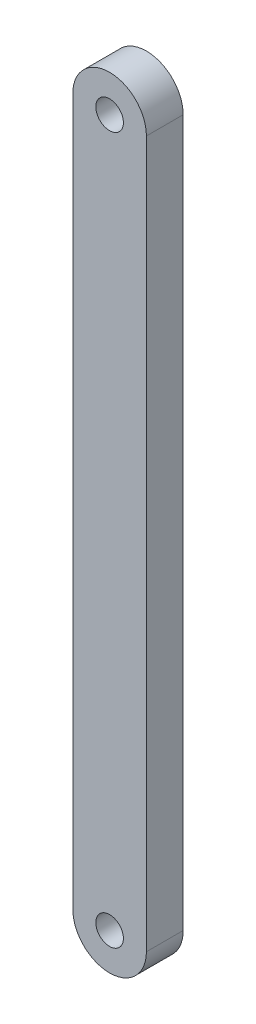
ISO-10303-21;
HEADER;
FILE_DESCRIPTION(('STEP AP214'),'2;1');
FILE_NAME('part.step','',(''),(''),'','','');
FILE_SCHEMA(('AUTOMOTIVE_DESIGN { 1 0 10303 214 1 1 1 1 }'));
ENDSEC;
DATA;
#1=APPLICATION_CONTEXT('core data for automotive mechanical design processes');
#2=APPLICATION_PROTOCOL_DEFINITION('international standard','automotive_design',2000,#1);
#3=PRODUCT_CONTEXT('',#1,'mechanical');
#4=PRODUCT('Part','Part','',(#3));
#5=PRODUCT_RELATED_PRODUCT_CATEGORY('part','',(#4));
#6=PRODUCT_DEFINITION_FORMATION('','',#4);
#7=PRODUCT_DEFINITION_CONTEXT('part definition',#1,'design');
#8=PRODUCT_DEFINITION('design','',#6,#7);
#9=PRODUCT_DEFINITION_SHAPE('','',#8);
#10=(LENGTH_UNIT() NAMED_UNIT(*) SI_UNIT(.MILLI.,.METRE.));
#11=(NAMED_UNIT(*) PLANE_ANGLE_UNIT() SI_UNIT($,.RADIAN.));
#12=(NAMED_UNIT(*) SI_UNIT($,.STERADIAN.) SOLID_ANGLE_UNIT());
#13=UNCERTAINTY_MEASURE_WITH_UNIT(LENGTH_MEASURE(1.E-05),#10,'distance_accuracy_value','');
#14=(GEOMETRIC_REPRESENTATION_CONTEXT(3) GLOBAL_UNCERTAINTY_ASSIGNED_CONTEXT((#13)) GLOBAL_UNIT_ASSIGNED_CONTEXT((#10,
#11,#12)) REPRESENTATION_CONTEXT('',''));
#15=CARTESIAN_POINT('',(0.,0.,0.));
#16=DIRECTION('',(0.,0.,1.));
#17=DIRECTION('',(1.,0.,0.));
#18=AXIS2_PLACEMENT_3D('',#15,#16,#17);
#19=CARTESIAN_POINT('',(0.,121.92,12.7));
#20=DIRECTION('',(0.,0.,1.));
#21=DIRECTION('',(1.,0.,0.));
#22=AXIS2_PLACEMENT_3D('',#19,#20,#21);
#23=PLANE('',#22);
#24=CARTESIAN_POINT('',(0.,121.92,12.7));
#25=DIRECTION('',(0.,0.,1.));
#26=DIRECTION('',(1.,0.,0.));
#27=AXIS2_PLACEMENT_3D('',#24,#25,#26);
#28=CIRCLE('',#27,4.7625);
#29=CARTESIAN_POINT('',(4.76249999999997,121.92,12.7));
#30=VERTEX_POINT('',#29);
#31=EDGE_CURVE('E100',#30,#30,#28,.T.);
#32=ORIENTED_EDGE('',*,*,#31,.F.);
#33=EDGE_LOOP('',(#32));
#34=FACE_BOUND('',#33,.T.);
#35=CARTESIAN_POINT('',(0.,121.92,12.7));
#36=DIRECTION('',(0.,0.,1.));
#37=DIRECTION('',(1.,0.,0.));
#38=AXIS2_PLACEMENT_3D('',#35,#36,#37);
#39=CIRCLE('',#38,12.7);
#40=CARTESIAN_POINT('',(12.7,121.92,12.7));
#41=VERTEX_POINT('',#40);
#42=CARTESIAN_POINT('',(-12.7,121.92,12.7));
#43=VERTEX_POINT('',#42);
#44=EDGE_CURVE('E85',#41,#43,#39,.T.);
#45=ORIENTED_EDGE('',*,*,#44,.T.);
#46=DIRECTION('',(0.,-1.,0.));
#47=VECTOR('',#46,1.);
#48=CARTESIAN_POINT('',(-12.7,121.92,12.7));
#49=LINE('',#48,#47);
#50=CARTESIAN_POINT('',(-12.7,-121.92,12.7));
#51=VERTEX_POINT('',#50);
#52=EDGE_CURVE('E80',#43,#51,#49,.T.);
#53=ORIENTED_EDGE('',*,*,#52,.T.);
#54=CARTESIAN_POINT('',(0.,-121.92,12.7));
#55=DIRECTION('',(0.,0.,1.));
#56=DIRECTION('',(1.,0.,0.));
#57=AXIS2_PLACEMENT_3D('',#54,#55,#56);
#58=CIRCLE('',#57,12.7);
#59=CARTESIAN_POINT('',(12.7,-121.92,12.7));
#60=VERTEX_POINT('',#59);
#61=EDGE_CURVE('E83',#51,#60,#58,.T.);
#62=ORIENTED_EDGE('',*,*,#61,.T.);
#63=DIRECTION('',(0.,1.,0.));
#64=VECTOR('',#63,1.);
#65=CARTESIAN_POINT('',(12.7,121.92,12.7));
#66=LINE('',#65,#64);
#67=EDGE_CURVE('E50',#60,#41,#66,.T.);
#68=ORIENTED_EDGE('',*,*,#67,.T.);
#69=EDGE_LOOP('',(#45,#53,#62,#68));
#70=FACE_BOUND('',#69,.T.);
#71=CARTESIAN_POINT('',(0.,-121.92,12.7));
#72=DIRECTION('',(0.,0.,1.));
#73=DIRECTION('',(1.,0.,0.));
#74=AXIS2_PLACEMENT_3D('',#71,#72,#73);
#75=CIRCLE('',#74,4.7625);
#76=CARTESIAN_POINT('',(4.76250000000004,-121.92,12.7));
#77=VERTEX_POINT('',#76);
#78=EDGE_CURVE('E115',#77,#77,#75,.T.);
#79=ORIENTED_EDGE('',*,*,#78,.F.);
#80=EDGE_LOOP('',(#79));
#81=FACE_BOUND('',#80,.T.);
#82=ADVANCED_FACE('F33',(#34,#70,#81),#23,.T.);
#83=CARTESIAN_POINT('',(0.,121.92,0.));
#84=DIRECTION('',(0.,0.,1.));
#85=DIRECTION('',(1.,0.,0.));
#86=AXIS2_PLACEMENT_3D('',#83,#84,#85);
#87=PLANE('',#86);
#88=CARTESIAN_POINT('',(0.,121.92,0.));
#89=DIRECTION('',(0.,0.,1.));
#90=DIRECTION('',(1.,0.,0.));
#91=AXIS2_PLACEMENT_3D('',#88,#89,#90);
#92=CIRCLE('',#91,12.7);
#93=CARTESIAN_POINT('',(12.7,121.92,0.));
#94=VERTEX_POINT('',#93);
#95=CARTESIAN_POINT('',(-12.7,121.92,0.));
#96=VERTEX_POINT('',#95);
#97=EDGE_CURVE('E97',#94,#96,#92,.T.);
#98=ORIENTED_EDGE('',*,*,#97,.F.);
#99=DIRECTION('',(0.,1.,0.));
#100=VECTOR('',#99,1.);
#101=CARTESIAN_POINT('',(12.7,121.92,0.));
#102=LINE('',#101,#100);
#103=CARTESIAN_POINT('',(12.7,-121.92,0.));
#104=VERTEX_POINT('',#103);
#105=EDGE_CURVE('E73',#104,#94,#102,.T.);
#106=ORIENTED_EDGE('',*,*,#105,.F.);
#107=CARTESIAN_POINT('',(0.,-121.92,0.));
#108=DIRECTION('',(0.,0.,1.));
#109=DIRECTION('',(1.,0.,0.));
#110=AXIS2_PLACEMENT_3D('',#107,#108,#109);
#111=CIRCLE('',#110,12.7);
#112=CARTESIAN_POINT('',(-12.7,-121.92,0.));
#113=VERTEX_POINT('',#112);
#114=EDGE_CURVE('E67',#113,#104,#111,.T.);
#115=ORIENTED_EDGE('',*,*,#114,.F.);
#116=DIRECTION('',(0.,-1.,0.));
#117=VECTOR('',#116,1.);
#118=CARTESIAN_POINT('',(-12.7,121.92,0.));
#119=LINE('',#118,#117);
#120=EDGE_CURVE('E89',#96,#113,#119,.T.);
#121=ORIENTED_EDGE('',*,*,#120,.F.);
#122=EDGE_LOOP('',(#98,#106,#115,#121));
#123=FACE_BOUND('',#122,.T.);
#124=CARTESIAN_POINT('',(0.,121.92,0.));
#125=DIRECTION('',(0.,0.,1.));
#126=DIRECTION('',(1.,0.,0.));
#127=AXIS2_PLACEMENT_3D('',#124,#125,#126);
#128=CIRCLE('',#127,4.7625);
#129=CARTESIAN_POINT('',(4.76249999999997,121.92,0.));
#130=VERTEX_POINT('',#129);
#131=EDGE_CURVE('E112',#130,#130,#128,.T.);
#132=ORIENTED_EDGE('',*,*,#131,.T.);
#133=EDGE_LOOP('',(#132));
#134=FACE_BOUND('',#133,.T.);
#135=CARTESIAN_POINT('',(0.,-121.92,0.));
#136=DIRECTION('',(0.,0.,1.));
#137=DIRECTION('',(1.,0.,0.));
#138=AXIS2_PLACEMENT_3D('',#135,#136,#137);
#139=CIRCLE('',#138,4.7625);
#140=CARTESIAN_POINT('',(4.76250000000004,-121.92,0.));
#141=VERTEX_POINT('',#140);
#142=EDGE_CURVE('E118',#141,#141,#139,.T.);
#143=ORIENTED_EDGE('',*,*,#142,.T.);
#144=EDGE_LOOP('',(#143));
#145=FACE_BOUND('',#144,.T.);
#146=ADVANCED_FACE('F108',(#123,#134,#145),#87,.F.);
#147=CARTESIAN_POINT('',(0.,121.92,12.7));
#148=DIRECTION('',(0.,0.,-1.));
#149=DIRECTION('',(-1.,0.,0.));
#150=AXIS2_PLACEMENT_3D('',#147,#148,#149);
#151=CYLINDRICAL_SURFACE('',#150,12.7);
#152=ORIENTED_EDGE('',*,*,#97,.T.);
#153=DIRECTION('',(0.,0.,-1.));
#154=VECTOR('',#153,1.);
#155=CARTESIAN_POINT('',(-12.7,121.92,12.7));
#156=LINE('',#155,#154);
#157=EDGE_CURVE('E11',#43,#96,#156,.T.);
#158=ORIENTED_EDGE('',*,*,#157,.F.);
#159=ORIENTED_EDGE('',*,*,#44,.F.);
#160=DIRECTION('',(0.,0.,-1.));
#161=VECTOR('',#160,1.);
#162=CARTESIAN_POINT('',(12.7,121.92,12.7));
#163=LINE('',#162,#161);
#164=EDGE_CURVE('E93',#41,#94,#163,.T.);
#165=ORIENTED_EDGE('',*,*,#164,.T.);
#166=EDGE_LOOP('',(#152,#158,#159,#165));
#167=FACE_BOUND('',#166,.T.);
#168=ADVANCED_FACE('F35',(#167),#151,.T.);
#169=CARTESIAN_POINT('',(-12.7,121.92,12.7));
#170=DIRECTION('',(1.,0.,0.));
#171=DIRECTION('',(0.,1.,0.));
#172=AXIS2_PLACEMENT_3D('',#169,#170,#171);
#173=PLANE('',#172);
#174=ORIENTED_EDGE('',*,*,#120,.T.);
#175=DIRECTION('',(0.,0.,-1.));
#176=VECTOR('',#175,1.);
#177=CARTESIAN_POINT('',(-12.7,-121.92,12.7));
#178=LINE('',#177,#176);
#179=EDGE_CURVE('E42',#51,#113,#178,.T.);
#180=ORIENTED_EDGE('',*,*,#179,.F.);
#181=ORIENTED_EDGE('',*,*,#52,.F.);
#182=ORIENTED_EDGE('',*,*,#157,.T.);
#183=EDGE_LOOP('',(#174,#180,#181,#182));
#184=FACE_BOUND('',#183,.T.);
#185=ADVANCED_FACE('F88',(#184),#173,.F.);
#186=CARTESIAN_POINT('',(0.,-121.92,12.7));
#187=DIRECTION('',(0.,0.,-1.));
#188=DIRECTION('',(-1.,0.,0.));
#189=AXIS2_PLACEMENT_3D('',#186,#187,#188);
#190=CYLINDRICAL_SURFACE('',#189,12.7);
#191=ORIENTED_EDGE('',*,*,#114,.T.);
#192=DIRECTION('',(0.,0.,-1.));
#193=VECTOR('',#192,1.);
#194=CARTESIAN_POINT('',(12.7,-121.92,12.7));
#195=LINE('',#194,#193);
#196=EDGE_CURVE('E90',#60,#104,#195,.T.);
#197=ORIENTED_EDGE('',*,*,#196,.F.);
#198=ORIENTED_EDGE('',*,*,#61,.F.);
#199=ORIENTED_EDGE('',*,*,#179,.T.);
#200=EDGE_LOOP('',(#191,#197,#198,#199));
#201=FACE_BOUND('',#200,.T.);
#202=ADVANCED_FACE('F91',(#201),#190,.T.);
#203=CARTESIAN_POINT('',(12.7,121.92,12.7));
#204=DIRECTION('',(-1.,0.,0.));
#205=DIRECTION('',(0.,-1.,0.));
#206=AXIS2_PLACEMENT_3D('',#203,#204,#205);
#207=PLANE('',#206);
#208=ORIENTED_EDGE('',*,*,#105,.T.);
#209=ORIENTED_EDGE('',*,*,#164,.F.);
#210=ORIENTED_EDGE('',*,*,#67,.F.);
#211=ORIENTED_EDGE('',*,*,#196,.T.);
#212=EDGE_LOOP('',(#208,#209,#210,#211));
#213=FACE_BOUND('',#212,.T.);
#214=ADVANCED_FACE('F105',(#213),#207,.F.);
#215=CARTESIAN_POINT('',(0.,121.92,12.7));
#216=DIRECTION('',(0.,0.,-1.));
#217=DIRECTION('',(-1.,0.,0.));
#218=AXIS2_PLACEMENT_3D('',#215,#216,#217);
#219=CYLINDRICAL_SURFACE('',#218,4.7625);
#220=ORIENTED_EDGE('',*,*,#31,.T.);
#221=EDGE_LOOP('',(#220));
#222=FACE_BOUND('',#221,.T.);
#223=ORIENTED_EDGE('',*,*,#131,.F.);
#224=EDGE_LOOP('',(#223));
#225=FACE_BOUND('',#224,.T.);
#226=ADVANCED_FACE('F135',(#222,#225),#219,.F.);
#227=CARTESIAN_POINT('',(0.,-121.92,12.7));
#228=DIRECTION('',(0.,0.,-1.));
#229=DIRECTION('',(-1.,0.,0.));
#230=AXIS2_PLACEMENT_3D('',#227,#228,#229);
#231=CYLINDRICAL_SURFACE('',#230,4.7625);
#232=ORIENTED_EDGE('',*,*,#78,.T.);
#233=EDGE_LOOP('',(#232));
#234=FACE_BOUND('',#233,.T.);
#235=ORIENTED_EDGE('',*,*,#142,.F.);
#236=EDGE_LOOP('',(#235));
#237=FACE_BOUND('',#236,.T.);
#238=ADVANCED_FACE('F124',(#234,#237),#231,.F.);
#239=CLOSED_SHELL('',(#82,#146,#168,#185,#202,#214,#226,#238));
#240=MANIFOLD_SOLID_BREP('B2',#239);
#241=ADVANCED_BREP_SHAPE_REPRESENTATION('',(#18,#240),#14);
#242=SHAPE_DEFINITION_REPRESENTATION(#9,#241);
ENDSEC;
END-ISO-10303-21;
